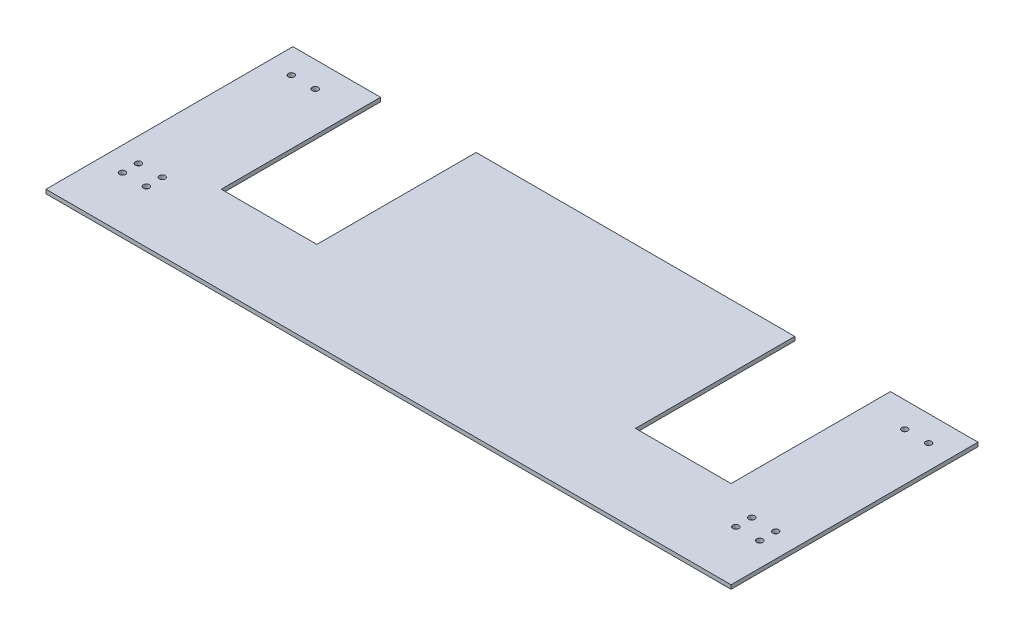
ISO-10303-21;
HEADER;
FILE_DESCRIPTION(('STEP AP214'),'2;1');
FILE_NAME('part.step','',(''),(''),'','','');
FILE_SCHEMA(('AUTOMOTIVE_DESIGN { 1 0 10303 214 1 1 1 1 }'));
ENDSEC;
DATA;
#1=APPLICATION_CONTEXT('core data for automotive mechanical design processes');
#2=APPLICATION_PROTOCOL_DEFINITION('international standard','automotive_design',2000,#1);
#3=PRODUCT_CONTEXT('',#1,'mechanical');
#4=PRODUCT('Part','Part','',(#3));
#5=PRODUCT_RELATED_PRODUCT_CATEGORY('part','',(#4));
#6=PRODUCT_DEFINITION_FORMATION('','',#4);
#7=PRODUCT_DEFINITION_CONTEXT('part definition',#1,'design');
#8=PRODUCT_DEFINITION('design','',#6,#7);
#9=PRODUCT_DEFINITION_SHAPE('','',#8);
#10=(LENGTH_UNIT() NAMED_UNIT(*) SI_UNIT(.MILLI.,.METRE.));
#11=(NAMED_UNIT(*) PLANE_ANGLE_UNIT() SI_UNIT($,.RADIAN.));
#12=(NAMED_UNIT(*) SI_UNIT($,.STERADIAN.) SOLID_ANGLE_UNIT());
#13=UNCERTAINTY_MEASURE_WITH_UNIT(LENGTH_MEASURE(1.E-05),#10,'distance_accuracy_value','');
#14=(GEOMETRIC_REPRESENTATION_CONTEXT(3) GLOBAL_UNCERTAINTY_ASSIGNED_CONTEXT((#13)) GLOBAL_UNIT_ASSIGNED_CONTEXT((#10,
#11,#12)) REPRESENTATION_CONTEXT('',''));
#15=CARTESIAN_POINT('',(0.,0.,0.));
#16=DIRECTION('',(0.,0.,1.));
#17=DIRECTION('',(1.,0.,0.));
#18=AXIS2_PLACEMENT_3D('',#15,#16,#17);
#19=CARTESIAN_POINT('',(-273.049999999999,1.5875,184.15));
#20=DIRECTION('',(0.,-1.,0.));
#21=DIRECTION('',(0.,0.,-1.));
#22=AXIS2_PLACEMENT_3D('',#19,#20,#21);
#23=PLANE('',#22);
#24=CARTESIAN_POINT('',(-253.999999999999,1.5875,142.24));
#25=DIRECTION('',(0.,1.,0.));
#26=DIRECTION('',(0.,0.,1.));
#27=AXIS2_PLACEMENT_3D('',#24,#25,#26);
#28=CIRCLE('',#27,2.413);
#29=CARTESIAN_POINT('',(-253.999999999999,1.5875,144.653));
#30=VERTEX_POINT('',#29);
#31=EDGE_CURVE('E311',#30,#30,#28,.T.);
#32=ORIENTED_EDGE('',*,*,#31,.F.);
#33=EDGE_LOOP('',(#32));
#34=FACE_BOUND('',#33,.T.);
#35=CARTESIAN_POINT('',(-234.949999999999,1.5875,142.24));
#36=DIRECTION('',(0.,1.,0.));
#37=DIRECTION('',(0.,0.,1.));
#38=AXIS2_PLACEMENT_3D('',#35,#36,#37);
#39=CIRCLE('',#38,2.413);
#40=CARTESIAN_POINT('',(-234.949999999999,1.5875,144.653));
#41=VERTEX_POINT('',#40);
#42=EDGE_CURVE('E305',#41,#41,#39,.T.);
#43=ORIENTED_EDGE('',*,*,#42,.F.);
#44=EDGE_LOOP('',(#43));
#45=FACE_BOUND('',#44,.T.);
#46=CARTESIAN_POINT('',(253.999999999999,1.5875,129.54));
#47=DIRECTION('',(0.,1.,0.));
#48=DIRECTION('',(0.,0.,1.));
#49=AXIS2_PLACEMENT_3D('',#46,#47,#48);
#50=CIRCLE('',#49,2.413);
#51=CARTESIAN_POINT('',(253.999999999999,1.5875,131.953));
#52=VERTEX_POINT('',#51);
#53=EDGE_CURVE('E206',#52,#52,#50,.T.);
#54=ORIENTED_EDGE('',*,*,#53,.F.);
#55=EDGE_LOOP('',(#54));
#56=FACE_BOUND('',#55,.T.);
#57=CARTESIAN_POINT('',(-234.949999999999,1.5875,7.62000000000002));
#58=DIRECTION('',(0.,1.,0.));
#59=DIRECTION('',(0.,0.,1.));
#60=AXIS2_PLACEMENT_3D('',#57,#58,#59);
#61=CIRCLE('',#60,2.413);
#62=CARTESIAN_POINT('',(-234.949999999999,1.5875,10.033));
#63=VERTEX_POINT('',#62);
#64=EDGE_CURVE('E199',#63,#63,#61,.T.);
#65=ORIENTED_EDGE('',*,*,#64,.F.);
#66=EDGE_LOOP('',(#65));
#67=FACE_BOUND('',#66,.T.);
#68=CARTESIAN_POINT('',(234.949999999999,1.5875,129.54));
#69=DIRECTION('',(0.,1.,0.));
#70=DIRECTION('',(0.,0.,1.));
#71=AXIS2_PLACEMENT_3D('',#68,#69,#70);
#72=CIRCLE('',#71,2.413);
#73=CARTESIAN_POINT('',(234.949999999999,1.5875,131.953));
#74=VERTEX_POINT('',#73);
#75=EDGE_CURVE('E176',#74,#74,#72,.T.);
#76=ORIENTED_EDGE('',*,*,#75,.F.);
#77=EDGE_LOOP('',(#76));
#78=FACE_BOUND('',#77,.T.);
#79=CARTESIAN_POINT('',(-253.999999999999,1.5875,7.62000000000002));
#80=DIRECTION('',(0.,1.,0.));
#81=DIRECTION('',(0.,0.,1.));
#82=AXIS2_PLACEMENT_3D('',#79,#80,#81);
#83=CIRCLE('',#82,2.413);
#84=CARTESIAN_POINT('',(-253.999999999999,1.5875,10.033));
#85=VERTEX_POINT('',#84);
#86=EDGE_CURVE('E202',#85,#85,#83,.T.);
#87=ORIENTED_EDGE('',*,*,#86,.F.);
#88=EDGE_LOOP('',(#87));
#89=FACE_BOUND('',#88,.T.);
#90=CARTESIAN_POINT('',(234.949999999999,1.5875,7.61999999999996));
#91=DIRECTION('',(0.,-1.,0.));
#92=DIRECTION('',(0.,0.,-1.));
#93=AXIS2_PLACEMENT_3D('',#90,#91,#92);
#94=CIRCLE('',#93,2.413);
#95=CARTESIAN_POINT('',(234.949999999999,1.5875,5.20699999999996));
#96=VERTEX_POINT('',#95);
#97=EDGE_CURVE('E182',#96,#96,#94,.T.);
#98=ORIENTED_EDGE('',*,*,#97,.T.);
#99=EDGE_LOOP('',(#98));
#100=FACE_BOUND('',#99,.T.);
#101=CARTESIAN_POINT('',(-253.999999999999,1.5875,129.54));
#102=DIRECTION('',(0.,-1.,0.));
#103=DIRECTION('',(0.,0.,-1.));
#104=AXIS2_PLACEMENT_3D('',#101,#102,#103);
#105=CIRCLE('',#104,2.413);
#106=CARTESIAN_POINT('',(-253.999999999999,1.5875,127.127));
#107=VERTEX_POINT('',#106);
#108=EDGE_CURVE('E169',#107,#107,#105,.T.);
#109=ORIENTED_EDGE('',*,*,#108,.T.);
#110=EDGE_LOOP('',(#109));
#111=FACE_BOUND('',#110,.T.);
#112=CARTESIAN_POINT('',(253.999999999999,1.5875,7.61999999999995));
#113=DIRECTION('',(0.,-1.,0.));
#114=DIRECTION('',(0.,0.,-1.));
#115=AXIS2_PLACEMENT_3D('',#112,#113,#114);
#116=CIRCLE('',#115,2.413);
#117=CARTESIAN_POINT('',(253.999999999999,1.5875,5.20699999999996));
#118=VERTEX_POINT('',#117);
#119=EDGE_CURVE('E187',#118,#118,#116,.T.);
#120=ORIENTED_EDGE('',*,*,#119,.T.);
#121=EDGE_LOOP('',(#120));
#122=FACE_BOUND('',#121,.T.);
#123=CARTESIAN_POINT('',(-234.949999999999,1.5875,129.54));
#124=DIRECTION('',(0.,-1.,0.));
#125=DIRECTION('',(0.,0.,-1.));
#126=AXIS2_PLACEMENT_3D('',#123,#124,#125);
#127=CIRCLE('',#126,2.413);
#128=CARTESIAN_POINT('',(-234.949999999999,1.5875,127.127));
#129=VERTEX_POINT('',#128);
#130=EDGE_CURVE('E194',#129,#129,#127,.T.);
#131=ORIENTED_EDGE('',*,*,#130,.T.);
#132=EDGE_LOOP('',(#131));
#133=FACE_BOUND('',#132,.T.);
#134=DIRECTION('',(0.,0.,1.));
#135=VECTOR('',#134,1.);
#136=CARTESIAN_POINT('',(-127.,1.5875,0.));
#137=LINE('',#136,#135);
#138=CARTESIAN_POINT('',(-127.,1.5875,-12.7));
#139=VERTEX_POINT('',#138);
#140=CARTESIAN_POINT('',(-127.,1.5875,114.3));
#141=VERTEX_POINT('',#140);
#142=EDGE_CURVE('E129',#139,#141,#137,.T.);
#143=ORIENTED_EDGE('',*,*,#142,.T.);
#144=DIRECTION('',(1.,0.,0.));
#145=VECTOR('',#144,1.);
#146=CARTESIAN_POINT('',(0.,1.5875,114.3));
#147=LINE('',#146,#145);
#148=CARTESIAN_POINT('',(-203.2,1.5875,114.3));
#149=VERTEX_POINT('',#148);
#150=EDGE_CURVE('E144',#149,#141,#147,.T.);
#151=ORIENTED_EDGE('',*,*,#150,.F.);
#152=DIRECTION('',(0.,0.,1.));
#153=VECTOR('',#152,1.);
#154=CARTESIAN_POINT('',(-203.2,1.5875,0.));
#155=LINE('',#154,#153);
#156=CARTESIAN_POINT('',(-203.2,1.5875,-12.7));
#157=VERTEX_POINT('',#156);
#158=EDGE_CURVE('E292',#157,#149,#155,.T.);
#159=ORIENTED_EDGE('',*,*,#158,.F.);
#160=DIRECTION('',(-1.,0.,0.));
#161=VECTOR('',#160,1.);
#162=CARTESIAN_POINT('',(273.050000000001,1.5875,-12.7));
#163=LINE('',#162,#161);
#164=CARTESIAN_POINT('',(-273.049999999999,1.5875,-12.7));
#165=VERTEX_POINT('',#164);
#166=EDGE_CURVE('E160',#157,#165,#163,.T.);
#167=ORIENTED_EDGE('',*,*,#166,.T.);
#168=DIRECTION('',(0.,0.,-1.));
#169=VECTOR('',#168,1.);
#170=CARTESIAN_POINT('',(-273.049999999999,1.5875,184.15));
#171=LINE('',#170,#169);
#172=CARTESIAN_POINT('',(-273.049999999999,1.5875,184.15));
#173=VERTEX_POINT('',#172);
#174=EDGE_CURVE('E44',#173,#165,#171,.T.);
#175=ORIENTED_EDGE('',*,*,#174,.F.);
#176=DIRECTION('',(-1.,0.,0.));
#177=VECTOR('',#176,1.);
#178=CARTESIAN_POINT('',(-273.049999999999,1.5875,184.15));
#179=LINE('',#178,#177);
#180=CARTESIAN_POINT('',(273.050000000001,1.5875,184.15));
#181=VERTEX_POINT('',#180);
#182=EDGE_CURVE('E219',#181,#173,#179,.T.);
#183=ORIENTED_EDGE('',*,*,#182,.F.);
#184=DIRECTION('',(0.,0.,-1.));
#185=VECTOR('',#184,1.);
#186=CARTESIAN_POINT('',(273.050000000001,1.5875,184.15));
#187=LINE('',#186,#185);
#188=CARTESIAN_POINT('',(273.050000000001,1.5875,-12.7));
#189=VERTEX_POINT('',#188);
#190=EDGE_CURVE('E11',#181,#189,#187,.T.);
#191=ORIENTED_EDGE('',*,*,#190,.T.);
#192=CARTESIAN_POINT('',(203.2,1.5875,-12.7));
#193=VERTEX_POINT('',#192);
#194=EDGE_CURVE('E161',#189,#193,#163,.T.);
#195=ORIENTED_EDGE('',*,*,#194,.T.);
#196=DIRECTION('',(0.,0.,1.));
#197=VECTOR('',#196,1.);
#198=CARTESIAN_POINT('',(203.2,1.5875,0.));
#199=LINE('',#198,#197);
#200=CARTESIAN_POINT('',(203.2,1.5875,114.3));
#201=VERTEX_POINT('',#200);
#202=EDGE_CURVE('E267',#193,#201,#199,.T.);
#203=ORIENTED_EDGE('',*,*,#202,.T.);
#204=DIRECTION('',(1.,0.,0.));
#205=VECTOR('',#204,1.);
#206=CARTESIAN_POINT('',(0.,1.5875,114.3));
#207=LINE('',#206,#205);
#208=CARTESIAN_POINT('',(127.,1.5875,114.3));
#209=VERTEX_POINT('',#208);
#210=EDGE_CURVE('E273',#209,#201,#207,.T.);
#211=ORIENTED_EDGE('',*,*,#210,.F.);
#212=DIRECTION('',(0.,0.,1.));
#213=VECTOR('',#212,1.);
#214=CARTESIAN_POINT('',(127.,1.5875,0.));
#215=LINE('',#214,#213);
#216=CARTESIAN_POINT('',(127.,1.5875,-12.7));
#217=VERTEX_POINT('',#216);
#218=EDGE_CURVE('E269',#217,#209,#215,.T.);
#219=ORIENTED_EDGE('',*,*,#218,.F.);
#220=EDGE_CURVE('E165',#217,#139,#163,.T.);
#221=ORIENTED_EDGE('',*,*,#220,.T.);
#222=EDGE_LOOP('',(#143,#151,#159,#167,#175,#183,#191,#195,#203,#211,#219,#221));
#223=FACE_BOUND('',#222,.T.);
#224=CARTESIAN_POINT('',(253.999999999999,1.5875,142.24));
#225=DIRECTION('',(0.,1.,0.));
#226=DIRECTION('',(0.,0.,1.));
#227=AXIS2_PLACEMENT_3D('',#224,#225,#226);
#228=CIRCLE('',#227,2.413);
#229=CARTESIAN_POINT('',(253.999999999999,1.5875,144.653));
#230=VERTEX_POINT('',#229);
#231=EDGE_CURVE('E298',#230,#230,#228,.F.);
#232=ORIENTED_EDGE('',*,*,#231,.T.);
#233=EDGE_LOOP('',(#232));
#234=FACE_BOUND('',#233,.T.);
#235=CARTESIAN_POINT('',(234.949999999999,1.5875,142.24));
#236=DIRECTION('',(0.,1.,0.));
#237=DIRECTION('',(0.,0.,1.));
#238=AXIS2_PLACEMENT_3D('',#235,#236,#237);
#239=CIRCLE('',#238,2.41300000000003);
#240=CARTESIAN_POINT('',(234.949999999999,1.5875,144.653));
#241=VERTEX_POINT('',#240);
#242=EDGE_CURVE('E312',#241,#241,#239,.F.);
#243=ORIENTED_EDGE('',*,*,#242,.T.);
#244=EDGE_LOOP('',(#243));
#245=FACE_BOUND('',#244,.T.);
#246=ADVANCED_FACE('F36',(#34,#45,#56,#67,#78,#89,#100,#111,#122,#133,#223,#234,#245),#23,.F.);
#247=CARTESIAN_POINT('',(-273.049999999999,-1.5875,184.15));
#248=DIRECTION('',(0.,1.,0.));
#249=DIRECTION('',(0.,0.,1.));
#250=AXIS2_PLACEMENT_3D('',#247,#248,#249);
#251=PLANE('',#250);
#252=CARTESIAN_POINT('',(-253.999999999999,-1.5875,142.24));
#253=DIRECTION('',(0.,1.,0.));
#254=DIRECTION('',(0.,0.,1.));
#255=AXIS2_PLACEMENT_3D('',#252,#253,#254);
#256=CIRCLE('',#255,2.413);
#257=CARTESIAN_POINT('',(-253.999999999999,-1.5875,144.653));
#258=VERTEX_POINT('',#257);
#259=EDGE_CURVE('E270',#258,#258,#256,.T.);
#260=ORIENTED_EDGE('',*,*,#259,.T.);
#261=EDGE_LOOP('',(#260));
#262=FACE_BOUND('',#261,.T.);
#263=CARTESIAN_POINT('',(-234.949999999999,-1.5875,142.24));
#264=DIRECTION('',(0.,1.,0.));
#265=DIRECTION('',(0.,0.,1.));
#266=AXIS2_PLACEMENT_3D('',#263,#264,#265);
#267=CIRCLE('',#266,2.413);
#268=CARTESIAN_POINT('',(-234.949999999999,-1.5875,144.653));
#269=VERTEX_POINT('',#268);
#270=EDGE_CURVE('E308',#269,#269,#267,.T.);
#271=ORIENTED_EDGE('',*,*,#270,.T.);
#272=EDGE_LOOP('',(#271));
#273=FACE_BOUND('',#272,.T.);
#274=CARTESIAN_POINT('',(253.999999999999,-1.5875,129.54));
#275=DIRECTION('',(0.,1.,0.));
#276=DIRECTION('',(0.,0.,1.));
#277=AXIS2_PLACEMENT_3D('',#274,#275,#276);
#278=CIRCLE('',#277,2.413);
#279=CARTESIAN_POINT('',(253.999999999999,-1.5875,131.953));
#280=VERTEX_POINT('',#279);
#281=EDGE_CURVE('E190',#280,#280,#278,.T.);
#282=ORIENTED_EDGE('',*,*,#281,.T.);
#283=EDGE_LOOP('',(#282));
#284=FACE_BOUND('',#283,.T.);
#285=CARTESIAN_POINT('',(-234.949999999999,-1.5875,7.62000000000002));
#286=DIRECTION('',(0.,1.,0.));
#287=DIRECTION('',(0.,0.,1.));
#288=AXIS2_PLACEMENT_3D('',#285,#286,#287);
#289=CIRCLE('',#288,2.413);
#290=CARTESIAN_POINT('',(-234.949999999999,-1.5875,10.033));
#291=VERTEX_POINT('',#290);
#292=EDGE_CURVE('E203',#291,#291,#289,.T.);
#293=ORIENTED_EDGE('',*,*,#292,.T.);
#294=EDGE_LOOP('',(#293));
#295=FACE_BOUND('',#294,.T.);
#296=CARTESIAN_POINT('',(234.949999999999,-1.5875,129.54));
#297=DIRECTION('',(0.,1.,0.));
#298=DIRECTION('',(0.,0.,1.));
#299=AXIS2_PLACEMENT_3D('',#296,#297,#298);
#300=CIRCLE('',#299,2.413);
#301=CARTESIAN_POINT('',(234.949999999999,-1.5875,131.953));
#302=VERTEX_POINT('',#301);
#303=EDGE_CURVE('E179',#302,#302,#300,.T.);
#304=ORIENTED_EDGE('',*,*,#303,.T.);
#305=EDGE_LOOP('',(#304));
#306=FACE_BOUND('',#305,.T.);
#307=CARTESIAN_POINT('',(-253.999999999999,-1.5875,7.62000000000002));
#308=DIRECTION('',(0.,1.,0.));
#309=DIRECTION('',(0.,0.,1.));
#310=AXIS2_PLACEMENT_3D('',#307,#308,#309);
#311=CIRCLE('',#310,2.413);
#312=CARTESIAN_POINT('',(-253.999999999999,-1.5875,10.033));
#313=VERTEX_POINT('',#312);
#314=EDGE_CURVE('E211',#313,#313,#311,.T.);
#315=ORIENTED_EDGE('',*,*,#314,.T.);
#316=EDGE_LOOP('',(#315));
#317=FACE_BOUND('',#316,.T.);
#318=CARTESIAN_POINT('',(234.949999999999,-1.5875,7.61999999999996));
#319=DIRECTION('',(0.,-1.,0.));
#320=DIRECTION('',(0.,0.,-1.));
#321=AXIS2_PLACEMENT_3D('',#318,#319,#320);
#322=CIRCLE('',#321,2.413);
#323=CARTESIAN_POINT('',(234.949999999999,-1.5875,5.20699999999996));
#324=VERTEX_POINT('',#323);
#325=EDGE_CURVE('E168',#324,#324,#322,.T.);
#326=ORIENTED_EDGE('',*,*,#325,.F.);
#327=EDGE_LOOP('',(#326));
#328=FACE_BOUND('',#327,.T.);
#329=CARTESIAN_POINT('',(-253.999999999999,-1.5875,129.54));
#330=DIRECTION('',(0.,-1.,0.));
#331=DIRECTION('',(0.,0.,-1.));
#332=AXIS2_PLACEMENT_3D('',#329,#330,#331);
#333=CIRCLE('',#332,2.413);
#334=CARTESIAN_POINT('',(-253.999999999999,-1.5875,127.127));
#335=VERTEX_POINT('',#334);
#336=EDGE_CURVE('E173',#335,#335,#333,.T.);
#337=ORIENTED_EDGE('',*,*,#336,.F.);
#338=EDGE_LOOP('',(#337));
#339=FACE_BOUND('',#338,.T.);
#340=CARTESIAN_POINT('',(253.999999999999,-1.5875,7.61999999999995));
#341=DIRECTION('',(0.,-1.,0.));
#342=DIRECTION('',(0.,0.,-1.));
#343=AXIS2_PLACEMENT_3D('',#340,#341,#342);
#344=CIRCLE('',#343,2.413);
#345=CARTESIAN_POINT('',(253.999999999999,-1.5875,5.20699999999996));
#346=VERTEX_POINT('',#345);
#347=EDGE_CURVE('E191',#346,#346,#344,.T.);
#348=ORIENTED_EDGE('',*,*,#347,.F.);
#349=EDGE_LOOP('',(#348));
#350=FACE_BOUND('',#349,.T.);
#351=CARTESIAN_POINT('',(-234.949999999999,-1.5875,129.54));
#352=DIRECTION('',(0.,-1.,0.));
#353=DIRECTION('',(0.,0.,-1.));
#354=AXIS2_PLACEMENT_3D('',#351,#352,#353);
#355=CIRCLE('',#354,2.413);
#356=CARTESIAN_POINT('',(-234.949999999999,-1.5875,127.127));
#357=VERTEX_POINT('',#356);
#358=EDGE_CURVE('E172',#357,#357,#355,.T.);
#359=ORIENTED_EDGE('',*,*,#358,.F.);
#360=EDGE_LOOP('',(#359));
#361=FACE_BOUND('',#360,.T.);
#362=DIRECTION('',(0.,0.,1.));
#363=VECTOR('',#362,1.);
#364=CARTESIAN_POINT('',(-127.,-1.5875,0.));
#365=LINE('',#364,#363);
#366=CARTESIAN_POINT('',(-127.,-1.5875,-12.7));
#367=VERTEX_POINT('',#366);
#368=CARTESIAN_POINT('',(-127.,-1.5875,114.3));
#369=VERTEX_POINT('',#368);
#370=EDGE_CURVE('E126',#367,#369,#365,.T.);
#371=ORIENTED_EDGE('',*,*,#370,.F.);
#372=DIRECTION('',(-1.,0.,0.));
#373=VECTOR('',#372,1.);
#374=CARTESIAN_POINT('',(273.050000000001,-1.5875,-12.7));
#375=LINE('',#374,#373);
#376=CARTESIAN_POINT('',(127.,-1.5875,-12.7));
#377=VERTEX_POINT('',#376);
#378=EDGE_CURVE('E142',#377,#367,#375,.T.);
#379=ORIENTED_EDGE('',*,*,#378,.F.);
#380=DIRECTION('',(0.,0.,1.));
#381=VECTOR('',#380,1.);
#382=CARTESIAN_POINT('',(127.,-1.5875,0.));
#383=LINE('',#382,#381);
#384=CARTESIAN_POINT('',(127.,-1.5875,114.3));
#385=VERTEX_POINT('',#384);
#386=EDGE_CURVE('E59',#377,#385,#383,.T.);
#387=ORIENTED_EDGE('',*,*,#386,.T.);
#388=DIRECTION('',(1.,0.,0.));
#389=VECTOR('',#388,1.);
#390=CARTESIAN_POINT('',(0.,-1.5875,114.3));
#391=LINE('',#390,#389);
#392=CARTESIAN_POINT('',(203.2,-1.5875,114.3));
#393=VERTEX_POINT('',#392);
#394=EDGE_CURVE('E258',#385,#393,#391,.T.);
#395=ORIENTED_EDGE('',*,*,#394,.T.);
#396=DIRECTION('',(0.,0.,1.));
#397=VECTOR('',#396,1.);
#398=CARTESIAN_POINT('',(203.2,-1.5875,0.));
#399=LINE('',#398,#397);
#400=CARTESIAN_POINT('',(203.2,-1.5875,-12.7));
#401=VERTEX_POINT('',#400);
#402=EDGE_CURVE('E263',#401,#393,#399,.T.);
#403=ORIENTED_EDGE('',*,*,#402,.F.);
#404=CARTESIAN_POINT('',(273.050000000001,-1.5875,-12.7));
#405=VERTEX_POINT('',#404);
#406=EDGE_CURVE('E148',#405,#401,#375,.T.);
#407=ORIENTED_EDGE('',*,*,#406,.F.);
#408=DIRECTION('',(0.,0.,-1.));
#409=VECTOR('',#408,1.);
#410=CARTESIAN_POINT('',(273.050000000001,-1.5875,184.15));
#411=LINE('',#410,#409);
#412=CARTESIAN_POINT('',(273.050000000001,-1.5875,184.15));
#413=VERTEX_POINT('',#412);
#414=EDGE_CURVE('E225',#413,#405,#411,.T.);
#415=ORIENTED_EDGE('',*,*,#414,.F.);
#416=DIRECTION('',(1.,0.,0.));
#417=VECTOR('',#416,1.);
#418=CARTESIAN_POINT('',(-273.049999999999,-1.5875,184.15));
#419=LINE('',#418,#417);
#420=CARTESIAN_POINT('',(-273.049999999999,-1.5875,184.15));
#421=VERTEX_POINT('',#420);
#422=EDGE_CURVE('E223',#421,#413,#419,.T.);
#423=ORIENTED_EDGE('',*,*,#422,.F.);
#424=DIRECTION('',(0.,0.,-1.));
#425=VECTOR('',#424,1.);
#426=CARTESIAN_POINT('',(-273.049999999999,-1.5875,184.15));
#427=LINE('',#426,#425);
#428=CARTESIAN_POINT('',(-273.049999999999,-1.5875,-12.7));
#429=VERTEX_POINT('',#428);
#430=EDGE_CURVE('E227',#421,#429,#427,.T.);
#431=ORIENTED_EDGE('',*,*,#430,.T.);
#432=CARTESIAN_POINT('',(-203.2,-1.5875,-12.7));
#433=VERTEX_POINT('',#432);
#434=EDGE_CURVE('E149',#433,#429,#375,.T.);
#435=ORIENTED_EDGE('',*,*,#434,.F.);
#436=DIRECTION('',(0.,0.,1.));
#437=VECTOR('',#436,1.);
#438=CARTESIAN_POINT('',(-203.2,-1.5875,0.));
#439=LINE('',#438,#437);
#440=CARTESIAN_POINT('',(-203.2,-1.5875,114.3));
#441=VERTEX_POINT('',#440);
#442=EDGE_CURVE('E51',#433,#441,#439,.T.);
#443=ORIENTED_EDGE('',*,*,#442,.T.);
#444=DIRECTION('',(1.,0.,0.));
#445=VECTOR('',#444,1.);
#446=CARTESIAN_POINT('',(0.,-1.5875,114.3));
#447=LINE('',#446,#445);
#448=EDGE_CURVE('E135',#441,#369,#447,.T.);
#449=ORIENTED_EDGE('',*,*,#448,.T.);
#450=EDGE_LOOP('',(#371,#379,#387,#395,#403,#407,#415,#423,#431,#435,#443,#449));
#451=FACE_BOUND('',#450,.T.);
#452=CARTESIAN_POINT('',(253.999999999999,-1.5875,142.24));
#453=DIRECTION('',(0.,1.,0.));
#454=DIRECTION('',(0.,0.,1.));
#455=AXIS2_PLACEMENT_3D('',#452,#453,#454);
#456=CIRCLE('',#455,2.413);
#457=CARTESIAN_POINT('',(253.999999999999,-1.5875,144.653));
#458=VERTEX_POINT('',#457);
#459=EDGE_CURVE('E301',#458,#458,#456,.F.);
#460=ORIENTED_EDGE('',*,*,#459,.F.);
#461=EDGE_LOOP('',(#460));
#462=FACE_BOUND('',#461,.T.);
#463=CARTESIAN_POINT('',(234.949999999999,-1.5875,142.24));
#464=DIRECTION('',(0.,1.,0.));
#465=DIRECTION('',(0.,0.,1.));
#466=AXIS2_PLACEMENT_3D('',#463,#464,#465);
#467=CIRCLE('',#466,2.41300000000003);
#468=CARTESIAN_POINT('',(234.949999999999,-1.5875,144.653));
#469=VERTEX_POINT('',#468);
#470=EDGE_CURVE('E302',#469,#469,#467,.F.);
#471=ORIENTED_EDGE('',*,*,#470,.F.);
#472=EDGE_LOOP('',(#471));
#473=FACE_BOUND('',#472,.T.);
#474=ADVANCED_FACE('F140',(#262,#273,#284,#295,#306,#317,#328,#339,#350,#361,#451,#462,#473),
#251,.F.);
#475=CARTESIAN_POINT('',(0.,0.,-12.7));
#476=DIRECTION('',(0.,0.,1.));
#477=DIRECTION('',(1.,0.,0.));
#478=AXIS2_PLACEMENT_3D('',#475,#476,#477);
#479=PLANE('',#478);
#480=DIRECTION('',(0.,1.,0.));
#481=VECTOR('',#480,1.);
#482=CARTESIAN_POINT('',(-127.,-1.5875,-12.7));
#483=LINE('',#482,#481);
#484=EDGE_CURVE('E123',#367,#139,#483,.T.);
#485=ORIENTED_EDGE('',*,*,#484,.T.);
#486=ORIENTED_EDGE('',*,*,#220,.F.);
#487=DIRECTION('',(0.,1.,0.));
#488=VECTOR('',#487,1.);
#489=CARTESIAN_POINT('',(127.,-1.5875,-12.7));
#490=LINE('',#489,#488);
#491=EDGE_CURVE('E147',#377,#217,#490,.T.);
#492=ORIENTED_EDGE('',*,*,#491,.F.);
#493=ORIENTED_EDGE('',*,*,#378,.T.);
#494=EDGE_LOOP('',(#485,#486,#492,#493));
#495=FACE_BOUND('',#494,.T.);
#496=ADVANCED_FACE('F146',(#495),#479,.F.);
#497=DIRECTION('',(0.,1.,0.));
#498=VECTOR('',#497,1.);
#499=CARTESIAN_POINT('',(203.2,-1.5875,-12.7));
#500=LINE('',#499,#498);
#501=EDGE_CURVE('E156',#401,#193,#500,.T.);
#502=ORIENTED_EDGE('',*,*,#501,.T.);
#503=ORIENTED_EDGE('',*,*,#194,.F.);
#504=DIRECTION('',(0.,-1.,0.));
#505=VECTOR('',#504,1.);
#506=CARTESIAN_POINT('',(273.050000000001,1.5875,-12.7));
#507=LINE('',#506,#505);
#508=EDGE_CURVE('E164',#189,#405,#507,.T.);
#509=ORIENTED_EDGE('',*,*,#508,.T.);
#510=ORIENTED_EDGE('',*,*,#406,.T.);
#511=EDGE_LOOP('',(#502,#503,#509,#510));
#512=FACE_BOUND('',#511,.T.);
#513=ADVANCED_FACE('F255',(#512),#479,.F.);
#514=CARTESIAN_POINT('',(273.050000000001,-1.5875,184.15));
#515=DIRECTION('',(-1.,0.,0.));
#516=DIRECTION('',(0.,0.,1.));
#517=AXIS2_PLACEMENT_3D('',#514,#515,#516);
#518=PLANE('',#517);
#519=ORIENTED_EDGE('',*,*,#414,.T.);
#520=ORIENTED_EDGE('',*,*,#508,.F.);
#521=ORIENTED_EDGE('',*,*,#190,.F.);
#522=DIRECTION('',(0.,1.,0.));
#523=VECTOR('',#522,1.);
#524=CARTESIAN_POINT('',(273.050000000001,-1.5875,184.15));
#525=LINE('',#524,#523);
#526=EDGE_CURVE('E214',#413,#181,#525,.T.);
#527=ORIENTED_EDGE('',*,*,#526,.F.);
#528=EDGE_LOOP('',(#519,#520,#521,#527));
#529=FACE_BOUND('',#528,.T.);
#530=ADVANCED_FACE('F38',(#529),#518,.F.);
#531=CARTESIAN_POINT('',(-273.049999999999,-1.5875,184.15));
#532=DIRECTION('',(1.,0.,0.));
#533=DIRECTION('',(0.,0.,-1.));
#534=AXIS2_PLACEMENT_3D('',#531,#532,#533);
#535=PLANE('',#534);
#536=ORIENTED_EDGE('',*,*,#174,.T.);
#537=DIRECTION('',(0.,-1.,0.));
#538=VECTOR('',#537,1.);
#539=CARTESIAN_POINT('',(-273.049999999999,1.5875,-12.7));
#540=LINE('',#539,#538);
#541=EDGE_CURVE('E152',#165,#429,#540,.T.);
#542=ORIENTED_EDGE('',*,*,#541,.T.);
#543=ORIENTED_EDGE('',*,*,#430,.F.);
#544=DIRECTION('',(0.,-1.,0.));
#545=VECTOR('',#544,1.);
#546=CARTESIAN_POINT('',(-273.049999999999,-1.5875,184.15));
#547=LINE('',#546,#545);
#548=EDGE_CURVE('E221',#173,#421,#547,.T.);
#549=ORIENTED_EDGE('',*,*,#548,.F.);
#550=EDGE_LOOP('',(#536,#542,#543,#549));
#551=FACE_BOUND('',#550,.T.);
#552=ADVANCED_FACE('F234',(#551),#535,.F.);
#553=CARTESIAN_POINT('',(0.,0.,184.15));
#554=DIRECTION('',(0.,0.,-1.));
#555=DIRECTION('',(-1.,0.,0.));
#556=AXIS2_PLACEMENT_3D('',#553,#554,#555);
#557=PLANE('',#556);
#558=ORIENTED_EDGE('',*,*,#526,.T.);
#559=ORIENTED_EDGE('',*,*,#182,.T.);
#560=ORIENTED_EDGE('',*,*,#548,.T.);
#561=ORIENTED_EDGE('',*,*,#422,.T.);
#562=EDGE_LOOP('',(#558,#559,#560,#561));
#563=FACE_BOUND('',#562,.T.);
#564=ADVANCED_FACE('F246',(#563),#557,.F.);
#565=CARTESIAN_POINT('',(-253.999999999999,-1.5875,7.62000000000002));
#566=DIRECTION('',(0.,1.,0.));
#567=DIRECTION('',(0.,0.,1.));
#568=AXIS2_PLACEMENT_3D('',#565,#566,#567);
#569=CYLINDRICAL_SURFACE('',#568,2.413);
#570=ORIENTED_EDGE('',*,*,#314,.F.);
#571=EDGE_LOOP('',(#570));
#572=FACE_BOUND('',#571,.T.);
#573=ORIENTED_EDGE('',*,*,#86,.T.);
#574=EDGE_LOOP('',(#573));
#575=FACE_BOUND('',#574,.T.);
#576=ADVANCED_FACE('F374',(#572,#575),#569,.F.);
#577=CARTESIAN_POINT('',(234.949999999999,-1.5875,7.61999999999996));
#578=DIRECTION('',(0.,1.,0.));
#579=DIRECTION('',(0.,0.,1.));
#580=AXIS2_PLACEMENT_3D('',#577,#578,#579);
#581=CYLINDRICAL_SURFACE('',#580,2.413);
#582=ORIENTED_EDGE('',*,*,#325,.T.);
#583=EDGE_LOOP('',(#582));
#584=FACE_BOUND('',#583,.T.);
#585=ORIENTED_EDGE('',*,*,#97,.F.);
#586=EDGE_LOOP('',(#585));
#587=FACE_BOUND('',#586,.T.);
#588=ADVANCED_FACE('F377',(#584,#587),#581,.F.);
#589=CARTESIAN_POINT('',(234.949999999999,-1.5875,129.54));
#590=DIRECTION('',(0.,1.,0.));
#591=DIRECTION('',(0.,0.,1.));
#592=AXIS2_PLACEMENT_3D('',#589,#590,#591);
#593=CYLINDRICAL_SURFACE('',#592,2.413);
#594=ORIENTED_EDGE('',*,*,#303,.F.);
#595=EDGE_LOOP('',(#594));
#596=FACE_BOUND('',#595,.T.);
#597=ORIENTED_EDGE('',*,*,#75,.T.);
#598=EDGE_LOOP('',(#597));
#599=FACE_BOUND('',#598,.T.);
#600=ADVANCED_FACE('F398',(#596,#599),#593,.F.);
#601=CARTESIAN_POINT('',(-253.999999999999,-1.5875,129.54));
#602=DIRECTION('',(0.,1.,0.));
#603=DIRECTION('',(0.,0.,1.));
#604=AXIS2_PLACEMENT_3D('',#601,#602,#603);
#605=CYLINDRICAL_SURFACE('',#604,2.413);
#606=ORIENTED_EDGE('',*,*,#336,.T.);
#607=EDGE_LOOP('',(#606));
#608=FACE_BOUND('',#607,.T.);
#609=ORIENTED_EDGE('',*,*,#108,.F.);
#610=EDGE_LOOP('',(#609));
#611=FACE_BOUND('',#610,.T.);
#612=ADVANCED_FACE('F369',(#608,#611),#605,.F.);
#613=CARTESIAN_POINT('',(-234.949999999999,-1.5875,7.62000000000002));
#614=DIRECTION('',(0.,1.,0.));
#615=DIRECTION('',(0.,0.,1.));
#616=AXIS2_PLACEMENT_3D('',#613,#614,#615);
#617=CYLINDRICAL_SURFACE('',#616,2.413);
#618=ORIENTED_EDGE('',*,*,#292,.F.);
#619=EDGE_LOOP('',(#618));
#620=FACE_BOUND('',#619,.T.);
#621=ORIENTED_EDGE('',*,*,#64,.T.);
#622=EDGE_LOOP('',(#621));
#623=FACE_BOUND('',#622,.T.);
#624=ADVANCED_FACE('F366',(#620,#623),#617,.F.);
#625=CARTESIAN_POINT('',(253.999999999999,-1.5875,129.54));
#626=DIRECTION('',(0.,1.,0.));
#627=DIRECTION('',(0.,0.,1.));
#628=AXIS2_PLACEMENT_3D('',#625,#626,#627);
#629=CYLINDRICAL_SURFACE('',#628,2.413);
#630=ORIENTED_EDGE('',*,*,#281,.F.);
#631=EDGE_LOOP('',(#630));
#632=FACE_BOUND('',#631,.T.);
#633=ORIENTED_EDGE('',*,*,#53,.T.);
#634=EDGE_LOOP('',(#633));
#635=FACE_BOUND('',#634,.T.);
#636=ADVANCED_FACE('F361',(#632,#635),#629,.F.);
#637=CARTESIAN_POINT('',(253.999999999999,-1.5875,7.61999999999995));
#638=DIRECTION('',(0.,1.,0.));
#639=DIRECTION('',(0.,0.,1.));
#640=AXIS2_PLACEMENT_3D('',#637,#638,#639);
#641=CYLINDRICAL_SURFACE('',#640,2.413);
#642=ORIENTED_EDGE('',*,*,#347,.T.);
#643=EDGE_LOOP('',(#642));
#644=FACE_BOUND('',#643,.T.);
#645=ORIENTED_EDGE('',*,*,#119,.F.);
#646=EDGE_LOOP('',(#645));
#647=FACE_BOUND('',#646,.T.);
#648=ADVANCED_FACE('F353',(#644,#647),#641,.F.);
#649=CARTESIAN_POINT('',(-234.949999999999,-1.5875,129.54));
#650=DIRECTION('',(0.,1.,0.));
#651=DIRECTION('',(0.,0.,1.));
#652=AXIS2_PLACEMENT_3D('',#649,#650,#651);
#653=CYLINDRICAL_SURFACE('',#652,2.413);
#654=ORIENTED_EDGE('',*,*,#358,.T.);
#655=EDGE_LOOP('',(#654));
#656=FACE_BOUND('',#655,.T.);
#657=ORIENTED_EDGE('',*,*,#130,.F.);
#658=EDGE_LOOP('',(#657));
#659=FACE_BOUND('',#658,.T.);
#660=ADVANCED_FACE('F351',(#656,#659),#653,.F.);
#661=ORIENTED_EDGE('',*,*,#166,.F.);
#662=DIRECTION('',(0.,1.,0.));
#663=VECTOR('',#662,1.);
#664=CARTESIAN_POINT('',(-203.2,-1.5875,-12.7));
#665=LINE('',#664,#663);
#666=EDGE_CURVE('E134',#433,#157,#665,.T.);
#667=ORIENTED_EDGE('',*,*,#666,.F.);
#668=ORIENTED_EDGE('',*,*,#434,.T.);
#669=ORIENTED_EDGE('',*,*,#541,.F.);
#670=EDGE_LOOP('',(#661,#667,#668,#669));
#671=FACE_BOUND('',#670,.T.);
#672=ADVANCED_FACE('F239',(#671),#479,.F.);
#673=CARTESIAN_POINT('',(203.2,-1.5875,0.));
#674=DIRECTION('',(-1.,0.,0.));
#675=DIRECTION('',(0.,0.,1.));
#676=AXIS2_PLACEMENT_3D('',#673,#674,#675);
#677=PLANE('',#676);
#678=ORIENTED_EDGE('',*,*,#202,.F.);
#679=ORIENTED_EDGE('',*,*,#501,.F.);
#680=ORIENTED_EDGE('',*,*,#402,.T.);
#681=DIRECTION('',(0.,1.,0.));
#682=VECTOR('',#681,1.);
#683=CARTESIAN_POINT('',(203.2,-1.5875,114.3));
#684=LINE('',#683,#682);
#685=EDGE_CURVE('E276',#393,#201,#684,.T.);
#686=ORIENTED_EDGE('',*,*,#685,.T.);
#687=EDGE_LOOP('',(#678,#679,#680,#686));
#688=FACE_BOUND('',#687,.T.);
#689=ADVANCED_FACE('F284',(#688),#677,.T.);
#690=CARTESIAN_POINT('',(0.,-1.5875,114.3));
#691=DIRECTION('',(0.,0.,1.));
#692=DIRECTION('',(1.,0.,0.));
#693=AXIS2_PLACEMENT_3D('',#690,#691,#692);
#694=PLANE('',#693);
#695=ORIENTED_EDGE('',*,*,#210,.T.);
#696=ORIENTED_EDGE('',*,*,#685,.F.);
#697=ORIENTED_EDGE('',*,*,#394,.F.);
#698=DIRECTION('',(0.,1.,0.));
#699=VECTOR('',#698,1.);
#700=CARTESIAN_POINT('',(127.,-1.5875,114.3));
#701=LINE('',#700,#699);
#702=EDGE_CURVE('E259',#385,#209,#701,.T.);
#703=ORIENTED_EDGE('',*,*,#702,.T.);
#704=EDGE_LOOP('',(#695,#696,#697,#703));
#705=FACE_BOUND('',#704,.T.);
#706=ADVANCED_FACE('F279',(#705),#694,.F.);
#707=CARTESIAN_POINT('',(127.,-1.5875,0.));
#708=DIRECTION('',(-1.,0.,0.));
#709=DIRECTION('',(0.,0.,1.));
#710=AXIS2_PLACEMENT_3D('',#707,#708,#709);
#711=PLANE('',#710);
#712=ORIENTED_EDGE('',*,*,#218,.T.);
#713=ORIENTED_EDGE('',*,*,#702,.F.);
#714=ORIENTED_EDGE('',*,*,#386,.F.);
#715=ORIENTED_EDGE('',*,*,#491,.T.);
#716=EDGE_LOOP('',(#712,#713,#714,#715));
#717=FACE_BOUND('',#716,.T.);
#718=ADVANCED_FACE('F283',(#717),#711,.F.);
#719=CARTESIAN_POINT('',(-127.,-1.5875,0.));
#720=DIRECTION('',(-1.,0.,0.));
#721=DIRECTION('',(0.,0.,1.));
#722=AXIS2_PLACEMENT_3D('',#719,#720,#721);
#723=PLANE('',#722);
#724=ORIENTED_EDGE('',*,*,#142,.F.);
#725=ORIENTED_EDGE('',*,*,#484,.F.);
#726=ORIENTED_EDGE('',*,*,#370,.T.);
#727=DIRECTION('',(0.,1.,0.));
#728=VECTOR('',#727,1.);
#729=CARTESIAN_POINT('',(-127.,-1.5875,114.3));
#730=LINE('',#729,#728);
#731=EDGE_CURVE('E153',#369,#141,#730,.T.);
#732=ORIENTED_EDGE('',*,*,#731,.T.);
#733=EDGE_LOOP('',(#724,#725,#726,#732));
#734=FACE_BOUND('',#733,.T.);
#735=ADVANCED_FACE('F125',(#734),#723,.T.);
#736=CARTESIAN_POINT('',(0.,-1.5875,114.3));
#737=DIRECTION('',(0.,0.,1.));
#738=DIRECTION('',(1.,0.,0.));
#739=AXIS2_PLACEMENT_3D('',#736,#737,#738);
#740=PLANE('',#739);
#741=ORIENTED_EDGE('',*,*,#150,.T.);
#742=ORIENTED_EDGE('',*,*,#731,.F.);
#743=ORIENTED_EDGE('',*,*,#448,.F.);
#744=DIRECTION('',(0.,1.,0.));
#745=VECTOR('',#744,1.);
#746=CARTESIAN_POINT('',(-203.2,-1.5875,114.3));
#747=LINE('',#746,#745);
#748=EDGE_CURVE('E287',#441,#149,#747,.T.);
#749=ORIENTED_EDGE('',*,*,#748,.T.);
#750=EDGE_LOOP('',(#741,#742,#743,#749));
#751=FACE_BOUND('',#750,.T.);
#752=ADVANCED_FACE('F500',(#751),#740,.F.);
#753=CARTESIAN_POINT('',(-203.2,-1.5875,0.));
#754=DIRECTION('',(-1.,0.,0.));
#755=DIRECTION('',(0.,0.,1.));
#756=AXIS2_PLACEMENT_3D('',#753,#754,#755);
#757=PLANE('',#756);
#758=ORIENTED_EDGE('',*,*,#158,.T.);
#759=ORIENTED_EDGE('',*,*,#748,.F.);
#760=ORIENTED_EDGE('',*,*,#442,.F.);
#761=ORIENTED_EDGE('',*,*,#666,.T.);
#762=EDGE_LOOP('',(#758,#759,#760,#761));
#763=FACE_BOUND('',#762,.T.);
#764=ADVANCED_FACE('F509',(#763),#757,.F.);
#765=CARTESIAN_POINT('',(-234.949999999999,-1.5875,142.24));
#766=DIRECTION('',(0.,1.,0.));
#767=DIRECTION('',(0.,0.,1.));
#768=AXIS2_PLACEMENT_3D('',#765,#766,#767);
#769=CYLINDRICAL_SURFACE('',#768,2.413);
#770=ORIENTED_EDGE('',*,*,#270,.F.);
#771=EDGE_LOOP('',(#770));
#772=FACE_BOUND('',#771,.T.);
#773=ORIENTED_EDGE('',*,*,#42,.T.);
#774=EDGE_LOOP('',(#773));
#775=FACE_BOUND('',#774,.T.);
#776=ADVANCED_FACE('F519',(#772,#775),#769,.F.);
#777=CARTESIAN_POINT('',(253.999999999999,-1.5875,142.24));
#778=DIRECTION('',(0.,1.,0.));
#779=DIRECTION('',(0.,0.,1.));
#780=AXIS2_PLACEMENT_3D('',#777,#778,#779);
#781=CYLINDRICAL_SURFACE('',#780,2.413);
#782=ORIENTED_EDGE('',*,*,#459,.T.);
#783=EDGE_LOOP('',(#782));
#784=FACE_BOUND('',#783,.T.);
#785=ORIENTED_EDGE('',*,*,#231,.F.);
#786=EDGE_LOOP('',(#785));
#787=FACE_BOUND('',#786,.T.);
#788=ADVANCED_FACE('F542',(#784,#787),#781,.F.);
#789=CARTESIAN_POINT('',(234.949999999999,-1.5875,142.24));
#790=DIRECTION('',(0.,1.,0.));
#791=DIRECTION('',(0.,0.,1.));
#792=AXIS2_PLACEMENT_3D('',#789,#790,#791);
#793=CYLINDRICAL_SURFACE('',#792,2.41300000000003);
#794=ORIENTED_EDGE('',*,*,#470,.T.);
#795=EDGE_LOOP('',(#794));
#796=FACE_BOUND('',#795,.T.);
#797=ORIENTED_EDGE('',*,*,#242,.F.);
#798=EDGE_LOOP('',(#797));
#799=FACE_BOUND('',#798,.T.);
#800=ADVANCED_FACE('F327',(#796,#799),#793,.F.);
#801=CARTESIAN_POINT('',(-253.999999999999,-1.5875,142.24));
#802=DIRECTION('',(0.,1.,0.));
#803=DIRECTION('',(0.,0.,1.));
#804=AXIS2_PLACEMENT_3D('',#801,#802,#803);
#805=CYLINDRICAL_SURFACE('',#804,2.413);
#806=ORIENTED_EDGE('',*,*,#259,.F.);
#807=EDGE_LOOP('',(#806));
#808=FACE_BOUND('',#807,.T.);
#809=ORIENTED_EDGE('',*,*,#31,.T.);
#810=EDGE_LOOP('',(#809));
#811=FACE_BOUND('',#810,.T.);
#812=ADVANCED_FACE('F324',(#808,#811),#805,.F.);
#813=CLOSED_SHELL('',(#246,#474,#496,#513,#530,#552,#564,#576,#588,#600,#612,#624,#636,#648,
#660,#672,#689,#706,#718,#735,#752,#764,#776,#788,#800,#812));
#814=MANIFOLD_SOLID_BREP('B2',#813);
#815=ADVANCED_BREP_SHAPE_REPRESENTATION('',(#18,#814),#14);
#816=SHAPE_DEFINITION_REPRESENTATION(#9,#815);
ENDSEC;
END-ISO-10303-21;
